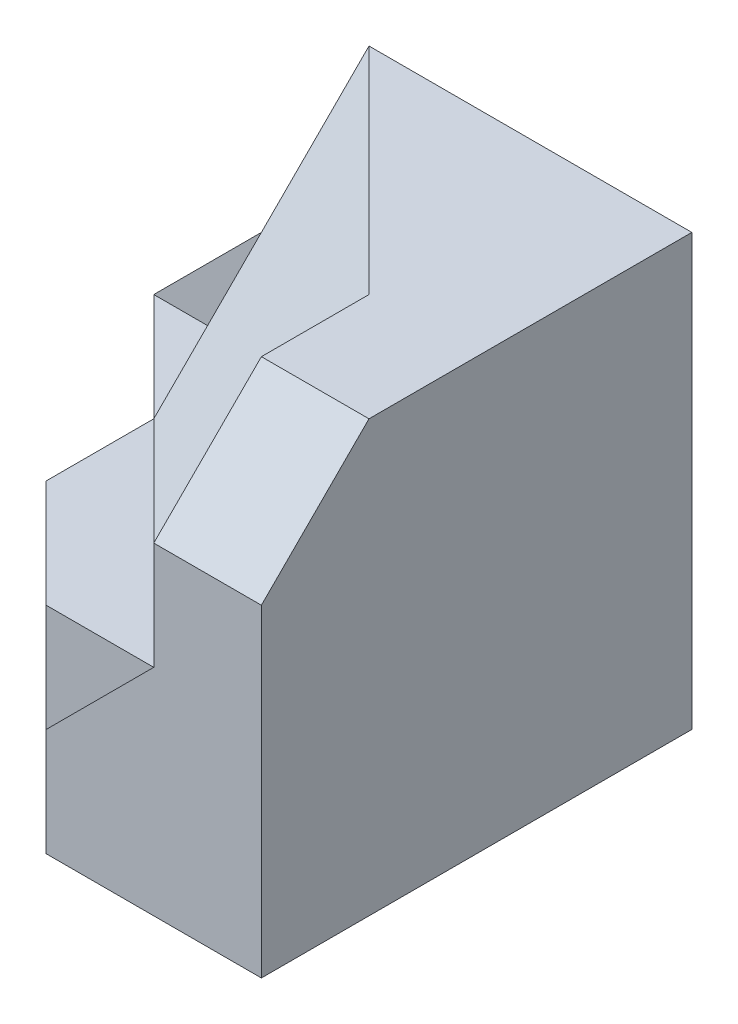
ISO-10303-21;
HEADER;
FILE_DESCRIPTION(('STEP AP214'),'2;1');
FILE_NAME('part.step','',(''),(''),'','','');
FILE_SCHEMA(('AUTOMOTIVE_DESIGN { 1 0 10303 214 1 1 1 1 }'));
ENDSEC;
DATA;
#1=APPLICATION_CONTEXT('core data for automotive mechanical design processes');
#2=APPLICATION_PROTOCOL_DEFINITION('international standard','automotive_design',2000,#1);
#3=PRODUCT_CONTEXT('',#1,'mechanical');
#4=PRODUCT('Part','Part','',(#3));
#5=PRODUCT_RELATED_PRODUCT_CATEGORY('part','',(#4));
#6=PRODUCT_DEFINITION_FORMATION('','',#4);
#7=PRODUCT_DEFINITION_CONTEXT('part definition',#1,'design');
#8=PRODUCT_DEFINITION('design','',#6,#7);
#9=PRODUCT_DEFINITION_SHAPE('','',#8);
#10=(LENGTH_UNIT() NAMED_UNIT(*) SI_UNIT(.MILLI.,.METRE.));
#11=(NAMED_UNIT(*) PLANE_ANGLE_UNIT() SI_UNIT($,.RADIAN.));
#12=(NAMED_UNIT(*) SI_UNIT($,.STERADIAN.) SOLID_ANGLE_UNIT());
#13=UNCERTAINTY_MEASURE_WITH_UNIT(LENGTH_MEASURE(1.E-05),#10,'distance_accuracy_value','');
#14=(GEOMETRIC_REPRESENTATION_CONTEXT(3) GLOBAL_UNCERTAINTY_ASSIGNED_CONTEXT((#13)) GLOBAL_UNIT_ASSIGNED_CONTEXT((#10,
#11,#12)) REPRESENTATION_CONTEXT('',''));
#15=CARTESIAN_POINT('',(0.,0.,0.));
#16=DIRECTION('',(0.,0.,1.));
#17=DIRECTION('',(1.,0.,0.));
#18=AXIS2_PLACEMENT_3D('',#15,#16,#17);
#19=CARTESIAN_POINT('',(-15.,0.,0.));
#20=DIRECTION('',(-1.,0.,0.));
#21=DIRECTION('',(0.,0.,1.));
#22=AXIS2_PLACEMENT_3D('',#19,#20,#21);
#23=PLANE('',#22);
#24=DIRECTION('',(0.,1.,0.));
#25=VECTOR('',#24,1.);
#26=CARTESIAN_POINT('',(-15.,0.,5.));
#27=LINE('',#26,#25);
#28=CARTESIAN_POINT('',(-15.,-10.,5.));
#29=VERTEX_POINT('',#28);
#30=CARTESIAN_POINT('',(-15.,-5.,5.));
#31=VERTEX_POINT('',#30);
#32=EDGE_CURVE('E321',#29,#31,#27,.T.);
#33=ORIENTED_EDGE('',*,*,#32,.F.);
#34=DIRECTION('',(0.,0.,-1.));
#35=VECTOR('',#34,1.);
#36=CARTESIAN_POINT('',(-15.,-10.,5.));
#37=LINE('',#36,#35);
#38=CARTESIAN_POINT('',(-15.,-10.,10.));
#39=VERTEX_POINT('',#38);
#40=EDGE_CURVE('E327',#39,#29,#37,.T.);
#41=ORIENTED_EDGE('',*,*,#40,.F.);
#42=DIRECTION('',(0.,0.707106781186548,-0.707106781186548));
#43=VECTOR('',#42,1.);
#44=CARTESIAN_POINT('',(-15.,-10.,10.));
#45=LINE('',#44,#43);
#46=EDGE_CURVE('E258',#39,#31,#45,.T.);
#47=ORIENTED_EDGE('',*,*,#46,.T.);
#48=EDGE_LOOP('',(#33,#41,#47));
#49=FACE_BOUND('',#48,.T.);
#50=ADVANCED_FACE('F36',(#49),#23,.T.);
#51=CARTESIAN_POINT('',(-20.,0.,5.));
#52=DIRECTION('',(0.,0.,-1.));
#53=DIRECTION('',(-1.,0.,0.));
#54=AXIS2_PLACEMENT_3D('',#51,#52,#53);
#55=PLANE('',#54);
#56=DIRECTION('',(-1.,0.,0.));
#57=VECTOR('',#56,1.);
#58=CARTESIAN_POINT('',(-20.,-10.,5.));
#59=LINE('',#58,#57);
#60=CARTESIAN_POINT('',(-20.,-10.,5.));
#61=VERTEX_POINT('',#60);
#62=EDGE_CURVE('E53',#29,#61,#59,.T.);
#63=ORIENTED_EDGE('',*,*,#62,.F.);
#64=ORIENTED_EDGE('',*,*,#32,.T.);
#65=DIRECTION('',(0.707106781186547,0.707106781186548,0.));
#66=VECTOR('',#65,1.);
#67=CARTESIAN_POINT('',(-20.,-10.,5.));
#68=LINE('',#67,#66);
#69=EDGE_CURVE('E339',#61,#31,#68,.T.);
#70=ORIENTED_EDGE('',*,*,#69,.F.);
#71=EDGE_LOOP('',(#63,#64,#70));
#72=FACE_BOUND('',#71,.T.);
#73=ADVANCED_FACE('F338',(#72),#55,.F.);
#74=CARTESIAN_POINT('',(0.,-15.,0.));
#75=DIRECTION('',(0.,-1.,0.));
#76=DIRECTION('',(0.,0.,-1.));
#77=AXIS2_PLACEMENT_3D('',#74,#75,#76);
#78=PLANE('',#77);
#79=DIRECTION('',(0.707106781186547,0.,0.707106781186547));
#80=VECTOR('',#79,1.);
#81=CARTESIAN_POINT('',(-15.,-15.,10.));
#82=LINE('',#81,#80);
#83=CARTESIAN_POINT('',(-20.,-15.,5.));
#84=VERTEX_POINT('',#83);
#85=CARTESIAN_POINT('',(-10.,-15.,15.));
#86=VERTEX_POINT('',#85);
#87=EDGE_CURVE('E61',#84,#86,#82,.T.);
#88=ORIENTED_EDGE('',*,*,#87,.F.);
#89=DIRECTION('',(0.,0.,-1.));
#90=VECTOR('',#89,1.);
#91=CARTESIAN_POINT('',(-20.,-15.,10.));
#92=LINE('',#91,#90);
#93=CARTESIAN_POINT('',(-20.,-15.,10.));
#94=VERTEX_POINT('',#93);
#95=EDGE_CURVE('E170',#94,#84,#92,.T.);
#96=ORIENTED_EDGE('',*,*,#95,.F.);
#97=DIRECTION('',(-0.707106781186548,0.,-0.707106781186547));
#98=VECTOR('',#97,1.);
#99=CARTESIAN_POINT('',(-15.,-15.,15.));
#100=LINE('',#99,#98);
#101=CARTESIAN_POINT('',(-15.,-15.,15.));
#102=VERTEX_POINT('',#101);
#103=EDGE_CURVE('E159',#102,#94,#100,.T.);
#104=ORIENTED_EDGE('',*,*,#103,.F.);
#105=DIRECTION('',(-1.,0.,0.));
#106=VECTOR('',#105,1.);
#107=CARTESIAN_POINT('',(-10.,-15.,15.));
#108=LINE('',#107,#106);
#109=EDGE_CURVE('E146',#86,#102,#108,.T.);
#110=ORIENTED_EDGE('',*,*,#109,.F.);
#111=EDGE_LOOP('',(#88,#96,#104,#110));
#112=FACE_BOUND('',#111,.T.);
#113=ADVANCED_FACE('F157',(#112),#78,.F.);
#114=CARTESIAN_POINT('',(-15.,0.,10.));
#115=DIRECTION('',(-0.707106781186548,0.,0.707106781186548));
#116=DIRECTION('',(0.707106781186548,0.,0.707106781186548));
#117=AXIS2_PLACEMENT_3D('',#114,#115,#116);
#118=PLANE('',#117);
#119=DIRECTION('',(-0.707106781186548,0.,-0.707106781186547));
#120=VECTOR('',#119,1.);
#121=CARTESIAN_POINT('',(-10.,-10.,15.));
#122=LINE('',#121,#120);
#123=CARTESIAN_POINT('',(-10.,-10.,15.));
#124=VERTEX_POINT('',#123);
#125=EDGE_CURVE('E241',#124,#39,#122,.T.);
#126=ORIENTED_EDGE('',*,*,#125,.T.);
#127=DIRECTION('',(0.707106781186547,0.,0.707106781186548));
#128=VECTOR('',#127,1.);
#129=CARTESIAN_POINT('',(-15.,-10.,10.));
#130=LINE('',#129,#128);
#131=EDGE_CURVE('E330',#61,#39,#130,.T.);
#132=ORIENTED_EDGE('',*,*,#131,.F.);
#133=DIRECTION('',(0.,1.,0.));
#134=VECTOR('',#133,1.);
#135=CARTESIAN_POINT('',(-20.,0.,5.));
#136=LINE('',#135,#134);
#137=EDGE_CURVE('E169',#84,#61,#136,.T.);
#138=ORIENTED_EDGE('',*,*,#137,.F.);
#139=ORIENTED_EDGE('',*,*,#87,.T.);
#140=DIRECTION('',(0.,-1.,0.));
#141=VECTOR('',#140,1.);
#142=CARTESIAN_POINT('',(-10.,0.,15.));
#143=LINE('',#142,#141);
#144=EDGE_CURVE('E167',#124,#86,#143,.T.);
#145=ORIENTED_EDGE('',*,*,#144,.F.);
#146=EDGE_LOOP('',(#126,#132,#138,#139,#145));
#147=FACE_BOUND('',#146,.T.);
#148=ADVANCED_FACE('F166',(#147),#118,.T.);
#149=CARTESIAN_POINT('',(-5.,0.,15.));
#150=DIRECTION('',(0.,0.,1.));
#151=DIRECTION('',(1.,0.,0.));
#152=AXIS2_PLACEMENT_3D('',#149,#150,#151);
#153=PLANE('',#152);
#154=DIRECTION('',(0.,-1.,0.));
#155=VECTOR('',#154,1.);
#156=CARTESIAN_POINT('',(-5.,0.,15.));
#157=LINE('',#156,#155);
#158=CARTESIAN_POINT('',(-5.,-5.,15.));
#159=VERTEX_POINT('',#158);
#160=CARTESIAN_POINT('',(-5.,-10.,15.));
#161=VERTEX_POINT('',#160);
#162=EDGE_CURVE('E181',#159,#161,#157,.T.);
#163=ORIENTED_EDGE('',*,*,#162,.F.);
#164=DIRECTION('',(-0.707106781186548,-0.707106781186547,0.));
#165=VECTOR('',#164,1.);
#166=CARTESIAN_POINT('',(-5.,-5.,15.));
#167=LINE('',#166,#165);
#168=EDGE_CURVE('E179',#159,#124,#167,.T.);
#169=ORIENTED_EDGE('',*,*,#168,.T.);
#170=ORIENTED_EDGE('',*,*,#144,.T.);
#171=DIRECTION('',(0.707106781186541,0.707106781186554,0.));
#172=VECTOR('',#171,1.);
#173=CARTESIAN_POINT('',(-5.,-10.,15.));
#174=LINE('',#173,#172);
#175=EDGE_CURVE('E178',#86,#161,#174,.T.);
#176=ORIENTED_EDGE('',*,*,#175,.T.);
#177=EDGE_LOOP('',(#163,#169,#170,#176));
#178=FACE_BOUND('',#177,.T.);
#179=ADVANCED_FACE('F177',(#178),#153,.T.);
#180=CARTESIAN_POINT('',(-5.,-20.,15.));
#181=DIRECTION('',(-1.,0.,0.));
#182=DIRECTION('',(0.,0.,1.));
#183=AXIS2_PLACEMENT_3D('',#180,#181,#182);
#184=PLANE('',#183);
#185=DIRECTION('',(0.,-0.707106781186547,0.707106781186548));
#186=VECTOR('',#185,1.);
#187=CARTESIAN_POINT('',(-5.,0.,10.));
#188=LINE('',#187,#186);
#189=CARTESIAN_POINT('',(-5.,0.,10.));
#190=VERTEX_POINT('',#189);
#191=EDGE_CURVE('E244',#190,#159,#188,.T.);
#192=ORIENTED_EDGE('',*,*,#191,.T.);
#193=ORIENTED_EDGE('',*,*,#162,.T.);
#194=DIRECTION('',(0.,0.,-1.));
#195=VECTOR('',#194,1.);
#196=CARTESIAN_POINT('',(-5.,-10.,20.));
#197=LINE('',#196,#195);
#198=CARTESIAN_POINT('',(-5.,-10.,20.));
#199=VERTEX_POINT('',#198);
#200=EDGE_CURVE('E155',#199,#161,#197,.T.);
#201=ORIENTED_EDGE('',*,*,#200,.F.);
#202=DIRECTION('',(0.,-1.,0.));
#203=VECTOR('',#202,1.);
#204=CARTESIAN_POINT('',(-5.,-20.,20.));
#205=LINE('',#204,#203);
#206=CARTESIAN_POINT('',(-5.,-5.,20.));
#207=VERTEX_POINT('',#206);
#208=EDGE_CURVE('E209',#207,#199,#205,.T.);
#209=ORIENTED_EDGE('',*,*,#208,.F.);
#210=DIRECTION('',(0.,-0.707106781186547,0.707106781186548));
#211=VECTOR('',#210,1.);
#212=CARTESIAN_POINT('',(-5.,0.,15.));
#213=LINE('',#212,#211);
#214=CARTESIAN_POINT('',(-5.,0.,15.));
#215=VERTEX_POINT('',#214);
#216=EDGE_CURVE('E199',#215,#207,#213,.T.);
#217=ORIENTED_EDGE('',*,*,#216,.F.);
#218=DIRECTION('',(0.,0.,1.));
#219=VECTOR('',#218,1.);
#220=CARTESIAN_POINT('',(-5.,0.,10.));
#221=LINE('',#220,#219);
#222=EDGE_CURVE('E240',#190,#215,#221,.T.);
#223=ORIENTED_EDGE('',*,*,#222,.F.);
#224=EDGE_LOOP('',(#192,#193,#201,#209,#217,#223));
#225=FACE_BOUND('',#224,.T.);
#226=ADVANCED_FACE('F38',(#225),#184,.T.);
#227=CARTESIAN_POINT('',(-15.,-20.,0.));
#228=DIRECTION('',(0.,0.,-1.));
#229=DIRECTION('',(-1.,0.,0.));
#230=AXIS2_PLACEMENT_3D('',#227,#228,#229);
#231=PLANE('',#230);
#232=DIRECTION('',(0.707106781186547,0.707106781186548,0.));
#233=VECTOR('',#232,1.);
#234=CARTESIAN_POINT('',(-20.,-10.,0.));
#235=LINE('',#234,#233);
#236=CARTESIAN_POINT('',(-20.,-10.,0.));
#237=VERTEX_POINT('',#236);
#238=CARTESIAN_POINT('',(-15.,-5.,0.));
#239=VERTEX_POINT('',#238);
#240=EDGE_CURVE('E283',#237,#239,#235,.T.);
#241=ORIENTED_EDGE('',*,*,#240,.T.);
#242=DIRECTION('',(0.,1.,0.));
#243=VECTOR('',#242,1.);
#244=CARTESIAN_POINT('',(-15.,-20.,0.));
#245=LINE('',#244,#243);
#246=CARTESIAN_POINT('',(-15.,0.,0.));
#247=VERTEX_POINT('',#246);
#248=EDGE_CURVE('E12',#239,#247,#245,.T.);
#249=ORIENTED_EDGE('',*,*,#248,.T.);
#250=DIRECTION('',(-1.,0.,0.));
#251=VECTOR('',#250,1.);
#252=CARTESIAN_POINT('',(-15.,0.,0.));
#253=LINE('',#252,#251);
#254=CARTESIAN_POINT('',(0.,0.,0.));
#255=VERTEX_POINT('',#254);
#256=EDGE_CURVE('E225',#255,#247,#253,.T.);
#257=ORIENTED_EDGE('',*,*,#256,.F.);
#258=DIRECTION('',(0.,1.,0.));
#259=VECTOR('',#258,1.);
#260=CARTESIAN_POINT('',(0.,-20.,0.));
#261=LINE('',#260,#259);
#262=CARTESIAN_POINT('',(0.,-20.,0.));
#263=VERTEX_POINT('',#262);
#264=EDGE_CURVE('E45',#263,#255,#261,.T.);
#265=ORIENTED_EDGE('',*,*,#264,.F.);
#266=DIRECTION('',(-1.,0.,0.));
#267=VECTOR('',#266,1.);
#268=CARTESIAN_POINT('',(-15.,-20.,0.));
#269=LINE('',#268,#267);
#270=CARTESIAN_POINT('',(-20.,-20.,0.));
#271=VERTEX_POINT('',#270);
#272=EDGE_CURVE('E224',#263,#271,#269,.T.);
#273=ORIENTED_EDGE('',*,*,#272,.T.);
#274=DIRECTION('',(0.,-1.,0.));
#275=VECTOR('',#274,1.);
#276=CARTESIAN_POINT('',(-20.,0.,0.));
#277=LINE('',#276,#275);
#278=EDGE_CURVE('E309',#237,#271,#277,.T.);
#279=ORIENTED_EDGE('',*,*,#278,.F.);
#280=EDGE_LOOP('',(#241,#249,#257,#265,#273,#279));
#281=FACE_BOUND('',#280,.T.);
#282=ADVANCED_FACE('F280',(#281),#231,.T.);
#283=CARTESIAN_POINT('',(0.,-20.,0.));
#284=DIRECTION('',(1.,0.,0.));
#285=DIRECTION('',(0.,0.,-1.));
#286=AXIS2_PLACEMENT_3D('',#283,#284,#285);
#287=PLANE('',#286);
#288=DIRECTION('',(0.,-0.707106781186547,0.707106781186548));
#289=VECTOR('',#288,1.);
#290=CARTESIAN_POINT('',(0.,0.,15.));
#291=LINE('',#290,#289);
#292=CARTESIAN_POINT('',(0.,0.,15.));
#293=VERTEX_POINT('',#292);
#294=CARTESIAN_POINT('',(0.,-5.,20.));
#295=VERTEX_POINT('',#294);
#296=EDGE_CURVE('E201',#293,#295,#291,.T.);
#297=ORIENTED_EDGE('',*,*,#296,.T.);
#298=DIRECTION('',(0.,1.,0.));
#299=VECTOR('',#298,1.);
#300=CARTESIAN_POINT('',(0.,0.,20.));
#301=LINE('',#300,#299);
#302=CARTESIAN_POINT('',(0.,-20.,20.));
#303=VERTEX_POINT('',#302);
#304=EDGE_CURVE('E217',#303,#295,#301,.T.);
#305=ORIENTED_EDGE('',*,*,#304,.F.);
#306=DIRECTION('',(0.,0.,-1.));
#307=VECTOR('',#306,1.);
#308=CARTESIAN_POINT('',(0.,-20.,0.));
#309=LINE('',#308,#307);
#310=EDGE_CURVE('E221',#303,#263,#309,.T.);
#311=ORIENTED_EDGE('',*,*,#310,.T.);
#312=ORIENTED_EDGE('',*,*,#264,.T.);
#313=DIRECTION('',(0.,0.,-1.));
#314=VECTOR('',#313,1.);
#315=CARTESIAN_POINT('',(0.,0.,0.));
#316=LINE('',#315,#314);
#317=EDGE_CURVE('E220',#293,#255,#316,.T.);
#318=ORIENTED_EDGE('',*,*,#317,.F.);
#319=EDGE_LOOP('',(#297,#305,#311,#312,#318));
#320=FACE_BOUND('',#319,.T.);
#321=ADVANCED_FACE('F300',(#320),#287,.T.);
#322=CARTESIAN_POINT('',(0.,-20.,0.));
#323=DIRECTION('',(0.,-1.,0.));
#324=DIRECTION('',(0.,0.,-1.));
#325=AXIS2_PLACEMENT_3D('',#322,#323,#324);
#326=PLANE('',#325);
#327=DIRECTION('',(0.,0.,1.));
#328=VECTOR('',#327,1.);
#329=CARTESIAN_POINT('',(-10.,-20.,15.));
#330=LINE('',#329,#328);
#331=CARTESIAN_POINT('',(-10.,-20.,15.));
#332=VERTEX_POINT('',#331);
#333=CARTESIAN_POINT('',(-10.,-20.,20.));
#334=VERTEX_POINT('',#333);
#335=EDGE_CURVE('E154',#332,#334,#330,.T.);
#336=ORIENTED_EDGE('',*,*,#335,.F.);
#337=DIRECTION('',(-1.,0.,0.));
#338=VECTOR('',#337,1.);
#339=CARTESIAN_POINT('',(-10.,-20.,15.));
#340=LINE('',#339,#338);
#341=CARTESIAN_POINT('',(-15.,-20.,15.));
#342=VERTEX_POINT('',#341);
#343=EDGE_CURVE('E149',#332,#342,#340,.T.);
#344=ORIENTED_EDGE('',*,*,#343,.T.);
#345=DIRECTION('',(-0.707106781186548,0.,-0.707106781186547));
#346=VECTOR('',#345,1.);
#347=CARTESIAN_POINT('',(-15.,-20.,15.));
#348=LINE('',#347,#346);
#349=CARTESIAN_POINT('',(-20.,-20.,10.));
#350=VERTEX_POINT('',#349);
#351=EDGE_CURVE('E353',#342,#350,#348,.T.);
#352=ORIENTED_EDGE('',*,*,#351,.T.);
#353=DIRECTION('',(0.,0.,1.));
#354=VECTOR('',#353,1.);
#355=CARTESIAN_POINT('',(-20.,-20.,0.));
#356=LINE('',#355,#354);
#357=EDGE_CURVE('E308',#271,#350,#356,.T.);
#358=ORIENTED_EDGE('',*,*,#357,.F.);
#359=ORIENTED_EDGE('',*,*,#272,.F.);
#360=ORIENTED_EDGE('',*,*,#310,.F.);
#361=DIRECTION('',(1.,0.,0.));
#362=VECTOR('',#361,1.);
#363=CARTESIAN_POINT('',(0.,-20.,20.));
#364=LINE('',#363,#362);
#365=EDGE_CURVE('E214',#334,#303,#364,.T.);
#366=ORIENTED_EDGE('',*,*,#365,.F.);
#367=EDGE_LOOP('',(#336,#344,#352,#358,#359,#360,#366));
#368=FACE_BOUND('',#367,.T.);
#369=ADVANCED_FACE('F304',(#368),#326,.T.);
#370=CARTESIAN_POINT('',(0.,0.,0.));
#371=DIRECTION('',(0.,-1.,0.));
#372=DIRECTION('',(0.,0.,-1.));
#373=AXIS2_PLACEMENT_3D('',#370,#371,#372);
#374=PLANE('',#373);
#375=ORIENTED_EDGE('',*,*,#256,.T.);
#376=DIRECTION('',(0.707106781186548,0.,0.707106781186547));
#377=VECTOR('',#376,1.);
#378=CARTESIAN_POINT('',(-15.,0.,0.));
#379=LINE('',#378,#377);
#380=EDGE_CURVE('E247',#247,#190,#379,.T.);
#381=ORIENTED_EDGE('',*,*,#380,.T.);
#382=ORIENTED_EDGE('',*,*,#222,.T.);
#383=DIRECTION('',(-1.,0.,0.));
#384=VECTOR('',#383,1.);
#385=CARTESIAN_POINT('',(0.,0.,15.));
#386=LINE('',#385,#384);
#387=EDGE_CURVE('E204',#293,#215,#386,.T.);
#388=ORIENTED_EDGE('',*,*,#387,.F.);
#389=ORIENTED_EDGE('',*,*,#317,.T.);
#390=EDGE_LOOP('',(#375,#381,#382,#388,#389));
#391=FACE_BOUND('',#390,.T.);
#392=ADVANCED_FACE('F274',(#391),#374,.F.);
#393=CARTESIAN_POINT('',(0.,0.,20.));
#394=DIRECTION('',(0.,0.,-1.));
#395=DIRECTION('',(-1.,0.,0.));
#396=AXIS2_PLACEMENT_3D('',#393,#394,#395);
#397=PLANE('',#396);
#398=ORIENTED_EDGE('',*,*,#208,.T.);
#399=DIRECTION('',(0.707106781186541,0.707106781186554,0.));
#400=VECTOR('',#399,1.);
#401=CARTESIAN_POINT('',(-5.,-10.,20.));
#402=LINE('',#401,#400);
#403=CARTESIAN_POINT('',(-10.,-15.0000000000001,20.));
#404=VERTEX_POINT('',#403);
#405=EDGE_CURVE('E180',#404,#199,#402,.T.);
#406=ORIENTED_EDGE('',*,*,#405,.F.);
#407=DIRECTION('',(0.,1.,0.));
#408=VECTOR('',#407,1.);
#409=CARTESIAN_POINT('',(-10.,-20.,20.));
#410=LINE('',#409,#408);
#411=EDGE_CURVE('E193',#334,#404,#410,.T.);
#412=ORIENTED_EDGE('',*,*,#411,.F.);
#413=ORIENTED_EDGE('',*,*,#365,.T.);
#414=ORIENTED_EDGE('',*,*,#304,.T.);
#415=DIRECTION('',(-1.,0.,0.));
#416=VECTOR('',#415,1.);
#417=CARTESIAN_POINT('',(0.,-5.,20.));
#418=LINE('',#417,#416);
#419=EDGE_CURVE('E206',#295,#207,#418,.T.);
#420=ORIENTED_EDGE('',*,*,#419,.T.);
#421=EDGE_LOOP('',(#398,#406,#412,#413,#414,#420));
#422=FACE_BOUND('',#421,.T.);
#423=ADVANCED_FACE('F302',(#422),#397,.F.);
#424=CARTESIAN_POINT('',(0.,0.,15.));
#425=DIRECTION('',(0.,-0.707106781186548,-0.707106781186547));
#426=DIRECTION('',(0.,0.707106781186547,-0.707106781186548));
#427=AXIS2_PLACEMENT_3D('',#424,#425,#426);
#428=PLANE('',#427);
#429=ORIENTED_EDGE('',*,*,#216,.T.);
#430=ORIENTED_EDGE('',*,*,#419,.F.);
#431=ORIENTED_EDGE('',*,*,#296,.F.);
#432=ORIENTED_EDGE('',*,*,#387,.T.);
#433=EDGE_LOOP('',(#429,#430,#431,#432));
#434=FACE_BOUND('',#433,.T.);
#435=ADVANCED_FACE('F297',(#434),#428,.F.);
#436=CARTESIAN_POINT('',(-10.,0.,0.));
#437=DIRECTION('',(-1.,0.,0.));
#438=DIRECTION('',(0.,0.,1.));
#439=AXIS2_PLACEMENT_3D('',#436,#437,#438);
#440=PLANE('',#439);
#441=DIRECTION('',(0.,0.,1.));
#442=VECTOR('',#441,1.);
#443=CARTESIAN_POINT('',(-10.,-15.0000000000001,15.));
#444=LINE('',#443,#442);
#445=EDGE_CURVE('E186',#86,#404,#444,.T.);
#446=ORIENTED_EDGE('',*,*,#445,.F.);
#447=DIRECTION('',(0.,-1.,0.));
#448=VECTOR('',#447,1.);
#449=CARTESIAN_POINT('',(-10.,-10.,15.));
#450=LINE('',#449,#448);
#451=EDGE_CURVE('E144',#86,#332,#450,.T.);
#452=ORIENTED_EDGE('',*,*,#451,.T.);
#453=ORIENTED_EDGE('',*,*,#335,.T.);
#454=ORIENTED_EDGE('',*,*,#411,.T.);
#455=EDGE_LOOP('',(#446,#452,#453,#454));
#456=FACE_BOUND('',#455,.T.);
#457=ADVANCED_FACE('F191',(#456),#440,.T.);
#458=CARTESIAN_POINT('',(-5.,-10.,15.));
#459=DIRECTION('',(0.707106781186554,-0.707106781186541,0.));
#460=DIRECTION('',(0.707106781186541,0.707106781186554,0.));
#461=AXIS2_PLACEMENT_3D('',#458,#459,#460);
#462=PLANE('',#461);
#463=ORIENTED_EDGE('',*,*,#405,.T.);
#464=ORIENTED_EDGE('',*,*,#200,.T.);
#465=ORIENTED_EDGE('',*,*,#175,.F.);
#466=ORIENTED_EDGE('',*,*,#445,.T.);
#467=EDGE_LOOP('',(#463,#464,#465,#466));
#468=FACE_BOUND('',#467,.T.);
#469=ADVANCED_FACE('F185',(#468),#462,.F.);
#470=DIRECTION('',(0.,0.,-1.));
#471=VECTOR('',#470,1.);
#472=CARTESIAN_POINT('',(-15.,-5.,0.));
#473=LINE('',#472,#471);
#474=EDGE_CURVE('E267',#31,#239,#473,.T.);
#475=ORIENTED_EDGE('',*,*,#474,.F.);
#476=EDGE_CURVE('E255',#31,#247,#45,.T.);
#477=ORIENTED_EDGE('',*,*,#476,.T.);
#478=ORIENTED_EDGE('',*,*,#248,.F.);
#479=EDGE_LOOP('',(#475,#477,#478));
#480=FACE_BOUND('',#479,.T.);
#481=ADVANCED_FACE('F287',(#480),#23,.T.);
#482=CARTESIAN_POINT('',(-5.,5.,5.));
#483=DIRECTION('',(0.577350269189626,-0.577350269189626,-0.577350269189626));
#484=DIRECTION('',(0.707106781186548,0.707106781186547,0.));
#485=AXIS2_PLACEMENT_3D('',#482,#483,#484);
#486=PLANE('',#485);
#487=ORIENTED_EDGE('',*,*,#125,.F.);
#488=ORIENTED_EDGE('',*,*,#168,.F.);
#489=ORIENTED_EDGE('',*,*,#191,.F.);
#490=ORIENTED_EDGE('',*,*,#380,.F.);
#491=ORIENTED_EDGE('',*,*,#476,.F.);
#492=ORIENTED_EDGE('',*,*,#46,.F.);
#493=EDGE_LOOP('',(#487,#488,#489,#490,#491,#492));
#494=FACE_BOUND('',#493,.T.);
#495=ADVANCED_FACE('F291',(#494),#486,.F.);
#496=CARTESIAN_POINT('',(-20.,0.,0.));
#497=DIRECTION('',(-1.,0.,0.));
#498=DIRECTION('',(0.,0.,1.));
#499=AXIS2_PLACEMENT_3D('',#496,#497,#498);
#500=PLANE('',#499);
#501=DIRECTION('',(0.,0.,1.));
#502=VECTOR('',#501,1.);
#503=CARTESIAN_POINT('',(-20.,-10.,0.));
#504=LINE('',#503,#502);
#505=EDGE_CURVE('E324',#237,#61,#504,.T.);
#506=ORIENTED_EDGE('',*,*,#505,.F.);
#507=ORIENTED_EDGE('',*,*,#278,.T.);
#508=ORIENTED_EDGE('',*,*,#357,.T.);
#509=DIRECTION('',(0.,-1.,0.));
#510=VECTOR('',#509,1.);
#511=CARTESIAN_POINT('',(-20.,-15.,10.));
#512=LINE('',#511,#510);
#513=EDGE_CURVE('E343',#94,#350,#512,.T.);
#514=ORIENTED_EDGE('',*,*,#513,.F.);
#515=ORIENTED_EDGE('',*,*,#95,.T.);
#516=ORIENTED_EDGE('',*,*,#137,.T.);
#517=EDGE_LOOP('',(#506,#507,#508,#514,#515,#516));
#518=FACE_BOUND('',#517,.T.);
#519=ADVANCED_FACE('F358',(#518),#500,.T.);
#520=CARTESIAN_POINT('',(-20.,-10.,0.));
#521=DIRECTION('',(0.707106781186548,-0.707106781186547,0.));
#522=DIRECTION('',(0.707106781186547,0.707106781186548,0.));
#523=AXIS2_PLACEMENT_3D('',#520,#521,#522);
#524=PLANE('',#523);
#525=ORIENTED_EDGE('',*,*,#69,.T.);
#526=ORIENTED_EDGE('',*,*,#474,.T.);
#527=ORIENTED_EDGE('',*,*,#240,.F.);
#528=ORIENTED_EDGE('',*,*,#505,.T.);
#529=EDGE_LOOP('',(#525,#526,#527,#528));
#530=FACE_BOUND('',#529,.T.);
#531=ADVANCED_FACE('F342',(#530),#524,.F.);
#532=CARTESIAN_POINT('',(-15.,-15.,15.));
#533=DIRECTION('',(-0.707106781186547,0.,0.707106781186548));
#534=DIRECTION('',(0.707106781186548,0.,0.707106781186547));
#535=AXIS2_PLACEMENT_3D('',#532,#533,#534);
#536=PLANE('',#535);
#537=ORIENTED_EDGE('',*,*,#351,.F.);
#538=DIRECTION('',(0.,-1.,0.));
#539=VECTOR('',#538,1.);
#540=CARTESIAN_POINT('',(-15.,-15.,15.));
#541=LINE('',#540,#539);
#542=EDGE_CURVE('E345',#102,#342,#541,.T.);
#543=ORIENTED_EDGE('',*,*,#542,.F.);
#544=ORIENTED_EDGE('',*,*,#103,.T.);
#545=ORIENTED_EDGE('',*,*,#513,.T.);
#546=EDGE_LOOP('',(#537,#543,#544,#545));
#547=FACE_BOUND('',#546,.T.);
#548=ADVANCED_FACE('F359',(#547),#536,.T.);
#549=CARTESIAN_POINT('',(-10.,-15.,15.));
#550=DIRECTION('',(0.,0.,1.));
#551=DIRECTION('',(1.,0.,0.));
#552=AXIS2_PLACEMENT_3D('',#549,#550,#551);
#553=PLANE('',#552);
#554=ORIENTED_EDGE('',*,*,#343,.F.);
#555=ORIENTED_EDGE('',*,*,#451,.F.);
#556=ORIENTED_EDGE('',*,*,#109,.T.);
#557=ORIENTED_EDGE('',*,*,#542,.T.);
#558=EDGE_LOOP('',(#554,#555,#556,#557));
#559=FACE_BOUND('',#558,.T.);
#560=ADVANCED_FACE('F145',(#559),#553,.T.);
#561=CARTESIAN_POINT('',(0.,-10.,0.));
#562=DIRECTION('',(0.,-1.,0.));
#563=DIRECTION('',(0.,0.,-1.));
#564=AXIS2_PLACEMENT_3D('',#561,#562,#563);
#565=PLANE('',#564);
#566=ORIENTED_EDGE('',*,*,#131,.T.);
#567=ORIENTED_EDGE('',*,*,#40,.T.);
#568=ORIENTED_EDGE('',*,*,#62,.T.);
#569=EDGE_LOOP('',(#566,#567,#568));
#570=FACE_BOUND('',#569,.T.);
#571=ADVANCED_FACE('F334',(#570),#565,.F.);
#572=CLOSED_SHELL('',(#50,#73,#113,#148,#179,#226,#282,#321,#369,#392,#423,#435,#457,#469,#481,
#495,#519,#531,#548,#560,#571));
#573=MANIFOLD_SOLID_BREP('B2',#572);
#574=ADVANCED_BREP_SHAPE_REPRESENTATION('',(#18,#573),#14);
#575=SHAPE_DEFINITION_REPRESENTATION(#9,#574);
ENDSEC;
END-ISO-10303-21;
